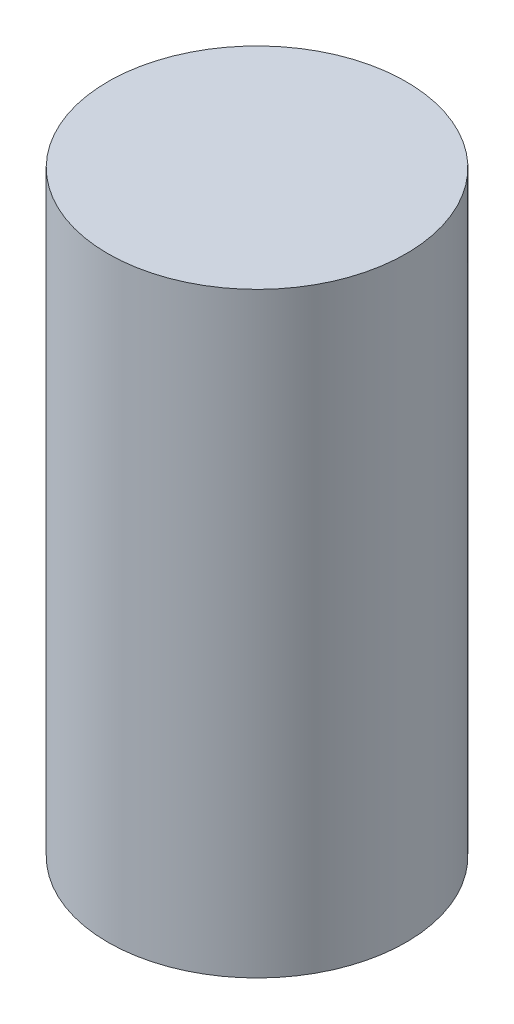
ISO-10303-21;
HEADER;
FILE_DESCRIPTION(('STEP AP214'),'2;1');
FILE_NAME('part.step','',(''),(''),'','','');
FILE_SCHEMA(('AUTOMOTIVE_DESIGN { 1 0 10303 214 1 1 1 1 }'));
ENDSEC;
DATA;
#1=APPLICATION_CONTEXT('core data for automotive mechanical design processes');
#2=APPLICATION_PROTOCOL_DEFINITION('international standard','automotive_design',2000,#1);
#3=PRODUCT_CONTEXT('',#1,'mechanical');
#4=PRODUCT('Part','Part','',(#3));
#5=PRODUCT_RELATED_PRODUCT_CATEGORY('part','',(#4));
#6=PRODUCT_DEFINITION_FORMATION('','',#4);
#7=PRODUCT_DEFINITION_CONTEXT('part definition',#1,'design');
#8=PRODUCT_DEFINITION('design','',#6,#7);
#9=PRODUCT_DEFINITION_SHAPE('','',#8);
#10=(LENGTH_UNIT() NAMED_UNIT(*) SI_UNIT(.MILLI.,.METRE.));
#11=(NAMED_UNIT(*) PLANE_ANGLE_UNIT() SI_UNIT($,.RADIAN.));
#12=(NAMED_UNIT(*) SI_UNIT($,.STERADIAN.) SOLID_ANGLE_UNIT());
#13=UNCERTAINTY_MEASURE_WITH_UNIT(LENGTH_MEASURE(1.E-05),#10,'distance_accuracy_value','');
#14=(GEOMETRIC_REPRESENTATION_CONTEXT(3) GLOBAL_UNCERTAINTY_ASSIGNED_CONTEXT((#13)) GLOBAL_UNIT_ASSIGNED_CONTEXT((#10,
#11,#12)) REPRESENTATION_CONTEXT('',''));
#15=CARTESIAN_POINT('',(0.,0.,0.));
#16=DIRECTION('',(0.,0.,1.));
#17=DIRECTION('',(1.,0.,0.));
#18=AXIS2_PLACEMENT_3D('',#15,#16,#17);
#19=CARTESIAN_POINT('',(0.,60.96,0.));
#20=DIRECTION('',(0.,-1.,0.));
#21=DIRECTION('',(0.,0.,-1.));
#22=AXIS2_PLACEMENT_3D('',#19,#20,#21);
#23=CYLINDRICAL_SURFACE('',#22,15.24);
#24=CARTESIAN_POINT('',(0.,60.96,0.));
#25=DIRECTION('',(0.,1.,0.));
#26=DIRECTION('',(0.,0.,1.));
#27=AXIS2_PLACEMENT_3D('',#24,#25,#26);
#28=CIRCLE('',#27,15.24);
#29=CARTESIAN_POINT('',(0.,60.96,15.24));
#30=VERTEX_POINT('',#29);
#31=EDGE_CURVE('E10',#30,#30,#28,.T.);
#32=ORIENTED_EDGE('',*,*,#31,.F.);
#33=EDGE_LOOP('',(#32));
#34=FACE_BOUND('',#33,.T.);
#35=CARTESIAN_POINT('',(0.,0.,0.));
#36=DIRECTION('',(0.,1.,0.));
#37=DIRECTION('',(0.,0.,1.));
#38=AXIS2_PLACEMENT_3D('',#35,#36,#37);
#39=CIRCLE('',#38,15.24);
#40=CARTESIAN_POINT('',(0.,0.,15.24));
#41=VERTEX_POINT('',#40);
#42=EDGE_CURVE('E34',#41,#41,#39,.T.);
#43=ORIENTED_EDGE('',*,*,#42,.T.);
#44=EDGE_LOOP('',(#43));
#45=FACE_BOUND('',#44,.T.);
#46=ADVANCED_FACE('F31',(#34,#45),#23,.T.);
#47=CARTESIAN_POINT('',(0.,60.96,0.));
#48=DIRECTION('',(0.,1.,0.));
#49=DIRECTION('',(0.,0.,1.));
#50=AXIS2_PLACEMENT_3D('',#47,#48,#49);
#51=PLANE('',#50);
#52=ORIENTED_EDGE('',*,*,#31,.T.);
#53=EDGE_LOOP('',(#52));
#54=FACE_BOUND('',#53,.T.);
#55=ADVANCED_FACE('F46',(#54),#51,.T.);
#56=CARTESIAN_POINT('',(0.,0.,0.));
#57=DIRECTION('',(0.,1.,0.));
#58=DIRECTION('',(0.,0.,1.));
#59=AXIS2_PLACEMENT_3D('',#56,#57,#58);
#60=PLANE('',#59);
#61=ORIENTED_EDGE('',*,*,#42,.F.);
#62=EDGE_LOOP('',(#61));
#63=FACE_BOUND('',#62,.T.);
#64=ADVANCED_FACE('F44',(#63),#60,.F.);
#65=CLOSED_SHELL('',(#46,#55,#64));
#66=MANIFOLD_SOLID_BREP('B2',#65);
#67=ADVANCED_BREP_SHAPE_REPRESENTATION('',(#18,#66),#14);
#68=SHAPE_DEFINITION_REPRESENTATION(#9,#67);
ENDSEC;
END-ISO-10303-21;
